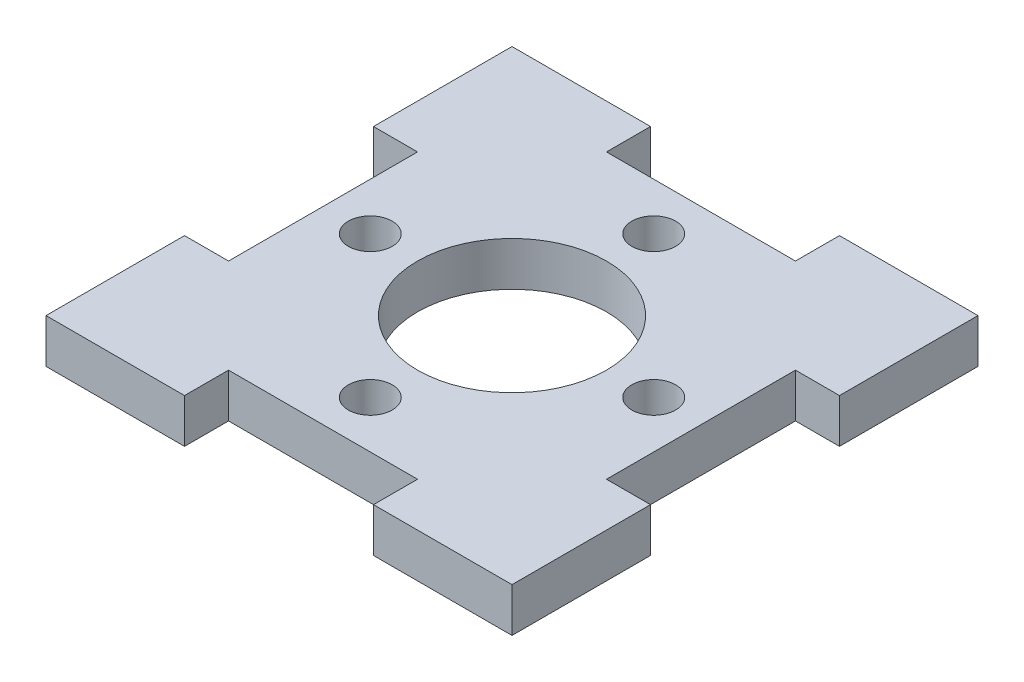
ISO-10303-21;
HEADER;
FILE_DESCRIPTION(('STEP AP214'),'2;1');
FILE_NAME('part.step','',(''),(''),'','','');
FILE_SCHEMA(('AUTOMOTIVE_DESIGN { 1 0 10303 214 1 1 1 1 }'));
ENDSEC;
DATA;
#1=APPLICATION_CONTEXT('core data for automotive mechanical design processes');
#2=APPLICATION_PROTOCOL_DEFINITION('international standard','automotive_design',2000,#1);
#3=PRODUCT_CONTEXT('',#1,'mechanical');
#4=PRODUCT('Part','Part','',(#3));
#5=PRODUCT_RELATED_PRODUCT_CATEGORY('part','',(#4));
#6=PRODUCT_DEFINITION_FORMATION('','',#4);
#7=PRODUCT_DEFINITION_CONTEXT('part definition',#1,'design');
#8=PRODUCT_DEFINITION('design','',#6,#7);
#9=PRODUCT_DEFINITION_SHAPE('','',#8);
#10=(LENGTH_UNIT() NAMED_UNIT(*) SI_UNIT(.MILLI.,.METRE.));
#11=(NAMED_UNIT(*) PLANE_ANGLE_UNIT() SI_UNIT($,.RADIAN.));
#12=(NAMED_UNIT(*) SI_UNIT($,.STERADIAN.) SOLID_ANGLE_UNIT());
#13=UNCERTAINTY_MEASURE_WITH_UNIT(LENGTH_MEASURE(1.E-05),#10,'distance_accuracy_value','');
#14=(GEOMETRIC_REPRESENTATION_CONTEXT(3) GLOBAL_UNCERTAINTY_ASSIGNED_CONTEXT((#13)) GLOBAL_UNIT_ASSIGNED_CONTEXT((#10,
#11,#12)) REPRESENTATION_CONTEXT('',''));
#15=CARTESIAN_POINT('',(0.,0.,0.));
#16=DIRECTION('',(0.,0.,1.));
#17=DIRECTION('',(1.,0.,0.));
#18=AXIS2_PLACEMENT_3D('',#15,#16,#17);
#19=CARTESIAN_POINT('',(2.79193692485513E-13,2.9591,6.34999999999931));
#20=DIRECTION('',(0.,0.,-1.));
#21=DIRECTION('',(-1.,0.,0.));
#22=AXIS2_PLACEMENT_3D('',#19,#20,#21);
#23=PLANE('',#22);
#24=DIRECTION('',(1.,0.,0.));
#25=VECTOR('',#24,1.);
#26=CARTESIAN_POINT('',(2.79193692485513E-13,0.,6.34999999999931));
#27=LINE('',#26,#25);
#28=CARTESIAN_POINT('',(-15.6591,0.,6.35));
#29=VERTEX_POINT('',#28);
#30=CARTESIAN_POINT('',(-12.7000000000001,0.,6.34999999999987));
#31=VERTEX_POINT('',#30);
#32=EDGE_CURVE('E247',#29,#31,#27,.T.);
#33=ORIENTED_EDGE('',*,*,#32,.F.);
#34=DIRECTION('',(0.,-1.,0.));
#35=VECTOR('',#34,1.);
#36=CARTESIAN_POINT('',(-15.6591,2.9591,6.35));
#37=LINE('',#36,#35);
#38=CARTESIAN_POINT('',(-15.6591,2.9591,6.35));
#39=VERTEX_POINT('',#38);
#40=EDGE_CURVE('E11',#39,#29,#37,.T.);
#41=ORIENTED_EDGE('',*,*,#40,.F.);
#42=DIRECTION('',(1.,0.,0.));
#43=VECTOR('',#42,1.);
#44=CARTESIAN_POINT('',(2.79193692485513E-13,2.9591,6.34999999999931));
#45=LINE('',#44,#43);
#46=CARTESIAN_POINT('',(-12.7000000000001,2.9591,6.34999999999987));
#47=VERTEX_POINT('',#46);
#48=EDGE_CURVE('E319',#39,#47,#45,.T.);
#49=ORIENTED_EDGE('',*,*,#48,.T.);
#50=DIRECTION('',(0.,-1.,0.));
#51=VECTOR('',#50,1.);
#52=CARTESIAN_POINT('',(-12.7000000000001,2.9591,6.34999999999987));
#53=LINE('',#52,#51);
#54=EDGE_CURVE('E52',#47,#31,#53,.T.);
#55=ORIENTED_EDGE('',*,*,#54,.T.);
#56=EDGE_LOOP('',(#33,#41,#49,#55));
#57=FACE_BOUND('',#56,.T.);
#58=ADVANCED_FACE('F35',(#57),#23,.T.);
#59=CARTESIAN_POINT('',(-15.6591,2.9591,0.));
#60=DIRECTION('',(1.,0.,0.));
#61=DIRECTION('',(0.,0.,-1.));
#62=AXIS2_PLACEMENT_3D('',#59,#60,#61);
#63=PLANE('',#62);
#64=DIRECTION('',(0.,0.,1.));
#65=VECTOR('',#64,1.);
#66=CARTESIAN_POINT('',(-15.6591,0.,0.));
#67=LINE('',#66,#65);
#68=CARTESIAN_POINT('',(-15.6591,0.,15.6591));
#69=VERTEX_POINT('',#68);
#70=EDGE_CURVE('E244',#29,#69,#67,.T.);
#71=ORIENTED_EDGE('',*,*,#70,.T.);
#72=DIRECTION('',(0.,-1.,0.));
#73=VECTOR('',#72,1.);
#74=CARTESIAN_POINT('',(-15.6591,2.9591,15.6591));
#75=LINE('',#74,#73);
#76=CARTESIAN_POINT('',(-15.6591,2.9591,15.6591));
#77=VERTEX_POINT('',#76);
#78=EDGE_CURVE('E44',#77,#69,#75,.T.);
#79=ORIENTED_EDGE('',*,*,#78,.F.);
#80=DIRECTION('',(0.,0.,1.));
#81=VECTOR('',#80,1.);
#82=CARTESIAN_POINT('',(-15.6591,2.9591,0.));
#83=LINE('',#82,#81);
#84=EDGE_CURVE('E321',#39,#77,#83,.T.);
#85=ORIENTED_EDGE('',*,*,#84,.F.);
#86=ORIENTED_EDGE('',*,*,#40,.T.);
#87=EDGE_LOOP('',(#71,#79,#85,#86));
#88=FACE_BOUND('',#87,.T.);
#89=ADVANCED_FACE('F245',(#88),#63,.F.);
#90=CARTESIAN_POINT('',(0.,2.9591,15.6591));
#91=DIRECTION('',(0.,0.,-1.));
#92=DIRECTION('',(-1.,0.,0.));
#93=AXIS2_PLACEMENT_3D('',#90,#91,#92);
#94=PLANE('',#93);
#95=DIRECTION('',(1.,0.,0.));
#96=VECTOR('',#95,1.);
#97=CARTESIAN_POINT('',(0.,0.,15.6591));
#98=LINE('',#97,#96);
#99=CARTESIAN_POINT('',(-6.35,0.,15.6591));
#100=VERTEX_POINT('',#99);
#101=EDGE_CURVE('E238',#69,#100,#98,.T.);
#102=ORIENTED_EDGE('',*,*,#101,.T.);
#103=DIRECTION('',(0.,-1.,0.));
#104=VECTOR('',#103,1.);
#105=CARTESIAN_POINT('',(-6.35,2.9591,15.6591));
#106=LINE('',#105,#104);
#107=CARTESIAN_POINT('',(-6.35,2.9591,15.6591));
#108=VERTEX_POINT('',#107);
#109=EDGE_CURVE('E229',#108,#100,#106,.T.);
#110=ORIENTED_EDGE('',*,*,#109,.F.);
#111=DIRECTION('',(1.,0.,0.));
#112=VECTOR('',#111,1.);
#113=CARTESIAN_POINT('',(0.,2.9591,15.6591));
#114=LINE('',#113,#112);
#115=EDGE_CURVE('E240',#77,#108,#114,.T.);
#116=ORIENTED_EDGE('',*,*,#115,.F.);
#117=ORIENTED_EDGE('',*,*,#78,.T.);
#118=EDGE_LOOP('',(#102,#110,#116,#117));
#119=FACE_BOUND('',#118,.T.);
#120=ADVANCED_FACE('F236',(#119),#94,.F.);
#121=CARTESIAN_POINT('',(-6.35000000000045,2.9591,1.82406545757228E-13));
#122=DIRECTION('',(-1.,0.,0.));
#123=DIRECTION('',(0.,0.,1.));
#124=AXIS2_PLACEMENT_3D('',#121,#122,#123);
#125=PLANE('',#124);
#126=DIRECTION('',(0.,0.,-1.));
#127=VECTOR('',#126,1.);
#128=CARTESIAN_POINT('',(-6.35000000000045,0.,1.82406545757228E-13));
#129=LINE('',#128,#127);
#130=CARTESIAN_POINT('',(-6.35000000000009,0.,12.6999999999999));
#131=VERTEX_POINT('',#130);
#132=EDGE_CURVE('E249',#100,#131,#129,.T.);
#133=ORIENTED_EDGE('',*,*,#132,.T.);
#134=DIRECTION('',(0.,-1.,0.));
#135=VECTOR('',#134,1.);
#136=CARTESIAN_POINT('',(-6.35000000000009,2.9591,12.6999999999999));
#137=LINE('',#136,#135);
#138=CARTESIAN_POINT('',(-6.35000000000009,2.9591,12.6999999999999));
#139=VERTEX_POINT('',#138);
#140=EDGE_CURVE('E227',#139,#131,#137,.T.);
#141=ORIENTED_EDGE('',*,*,#140,.F.);
#142=DIRECTION('',(0.,0.,-1.));
#143=VECTOR('',#142,1.);
#144=CARTESIAN_POINT('',(-6.35000000000045,2.9591,1.82406545757228E-13));
#145=LINE('',#144,#143);
#146=EDGE_CURVE('E324',#108,#139,#145,.T.);
#147=ORIENTED_EDGE('',*,*,#146,.F.);
#148=ORIENTED_EDGE('',*,*,#109,.T.);
#149=EDGE_LOOP('',(#133,#141,#147,#148));
#150=FACE_BOUND('',#149,.T.);
#151=ADVANCED_FACE('F384',(#150),#125,.F.);
#152=CARTESIAN_POINT('',(0.,2.9591,12.7));
#153=DIRECTION('',(0.,0.,1.));
#154=DIRECTION('',(1.,0.,0.));
#155=AXIS2_PLACEMENT_3D('',#152,#153,#154);
#156=PLANE('',#155);
#157=DIRECTION('',(-1.,0.,0.));
#158=VECTOR('',#157,1.);
#159=CARTESIAN_POINT('',(0.,0.,12.7));
#160=LINE('',#159,#158);
#161=CARTESIAN_POINT('',(6.34999999999991,0.,12.7));
#162=VERTEX_POINT('',#161);
#163=EDGE_CURVE('E257',#162,#131,#160,.T.);
#164=ORIENTED_EDGE('',*,*,#163,.F.);
#165=DIRECTION('',(0.,-1.,0.));
#166=VECTOR('',#165,1.);
#167=CARTESIAN_POINT('',(6.34999999999991,2.9591,12.7));
#168=LINE('',#167,#166);
#169=CARTESIAN_POINT('',(6.34999999999991,2.9591,12.7));
#170=VERTEX_POINT('',#169);
#171=EDGE_CURVE('E225',#170,#162,#168,.T.);
#172=ORIENTED_EDGE('',*,*,#171,.F.);
#173=DIRECTION('',(-1.,0.,0.));
#174=VECTOR('',#173,1.);
#175=CARTESIAN_POINT('',(0.,2.9591,12.7));
#176=LINE('',#175,#174);
#177=EDGE_CURVE('E326',#170,#139,#176,.T.);
#178=ORIENTED_EDGE('',*,*,#177,.T.);
#179=ORIENTED_EDGE('',*,*,#140,.T.);
#180=EDGE_LOOP('',(#164,#172,#178,#179));
#181=FACE_BOUND('',#180,.T.);
#182=ADVANCED_FACE('F387',(#181),#156,.T.);
#183=CARTESIAN_POINT('',(6.34999999999955,2.9591,-1.82406545757208E-13));
#184=DIRECTION('',(-1.,0.,0.));
#185=DIRECTION('',(0.,0.,1.));
#186=AXIS2_PLACEMENT_3D('',#183,#184,#185);
#187=PLANE('',#186);
#188=DIRECTION('',(0.,0.,-1.));
#189=VECTOR('',#188,1.);
#190=CARTESIAN_POINT('',(6.34999999999955,0.,-1.82406545757208E-13));
#191=LINE('',#190,#189);
#192=CARTESIAN_POINT('',(6.35,0.,15.6591));
#193=VERTEX_POINT('',#192);
#194=EDGE_CURVE('E260',#193,#162,#191,.T.);
#195=ORIENTED_EDGE('',*,*,#194,.F.);
#196=DIRECTION('',(0.,-1.,0.));
#197=VECTOR('',#196,1.);
#198=CARTESIAN_POINT('',(6.35,2.9591,15.6591));
#199=LINE('',#198,#197);
#200=CARTESIAN_POINT('',(6.35,2.9591,15.6591));
#201=VERTEX_POINT('',#200);
#202=EDGE_CURVE('E223',#201,#193,#199,.T.);
#203=ORIENTED_EDGE('',*,*,#202,.F.);
#204=DIRECTION('',(0.,0.,-1.));
#205=VECTOR('',#204,1.);
#206=CARTESIAN_POINT('',(6.34999999999955,2.9591,-1.82406545757208E-13));
#207=LINE('',#206,#205);
#208=EDGE_CURVE('E329',#201,#170,#207,.T.);
#209=ORIENTED_EDGE('',*,*,#208,.T.);
#210=ORIENTED_EDGE('',*,*,#171,.T.);
#211=EDGE_LOOP('',(#195,#203,#209,#210));
#212=FACE_BOUND('',#211,.T.);
#213=ADVANCED_FACE('F391',(#212),#187,.T.);
#214=CARTESIAN_POINT('',(0.,2.9591,15.6591));
#215=DIRECTION('',(0.,0.,-1.));
#216=DIRECTION('',(-1.,0.,0.));
#217=AXIS2_PLACEMENT_3D('',#214,#215,#216);
#218=PLANE('',#217);
#219=DIRECTION('',(1.,0.,0.));
#220=VECTOR('',#219,1.);
#221=CARTESIAN_POINT('',(0.,0.,15.6591));
#222=LINE('',#221,#220);
#223=CARTESIAN_POINT('',(15.6591,0.,15.6591));
#224=VERTEX_POINT('',#223);
#225=EDGE_CURVE('E263',#193,#224,#222,.T.);
#226=ORIENTED_EDGE('',*,*,#225,.T.);
#227=DIRECTION('',(0.,-1.,0.));
#228=VECTOR('',#227,1.);
#229=CARTESIAN_POINT('',(15.6591,2.9591,15.6591));
#230=LINE('',#229,#228);
#231=CARTESIAN_POINT('',(15.6591,2.9591,15.6591));
#232=VERTEX_POINT('',#231);
#233=EDGE_CURVE('E221',#232,#224,#230,.T.);
#234=ORIENTED_EDGE('',*,*,#233,.F.);
#235=DIRECTION('',(1.,0.,0.));
#236=VECTOR('',#235,1.);
#237=CARTESIAN_POINT('',(0.,2.9591,15.6591));
#238=LINE('',#237,#236);
#239=EDGE_CURVE('E332',#201,#232,#238,.T.);
#240=ORIENTED_EDGE('',*,*,#239,.F.);
#241=ORIENTED_EDGE('',*,*,#202,.T.);
#242=EDGE_LOOP('',(#226,#234,#240,#241));
#243=FACE_BOUND('',#242,.T.);
#244=ADVANCED_FACE('F395',(#243),#218,.F.);
#245=CARTESIAN_POINT('',(15.6591,2.9591,0.));
#246=DIRECTION('',(1.,0.,0.));
#247=DIRECTION('',(0.,0.,-1.));
#248=AXIS2_PLACEMENT_3D('',#245,#246,#247);
#249=PLANE('',#248);
#250=DIRECTION('',(0.,0.,1.));
#251=VECTOR('',#250,1.);
#252=CARTESIAN_POINT('',(15.6591,0.,0.));
#253=LINE('',#252,#251);
#254=CARTESIAN_POINT('',(15.6591,0.,6.35));
#255=VERTEX_POINT('',#254);
#256=EDGE_CURVE('E266',#255,#224,#253,.T.);
#257=ORIENTED_EDGE('',*,*,#256,.F.);
#258=DIRECTION('',(0.,-1.,0.));
#259=VECTOR('',#258,1.);
#260=CARTESIAN_POINT('',(15.6591,2.9591,6.35));
#261=LINE('',#260,#259);
#262=CARTESIAN_POINT('',(15.6591,2.9591,6.35));
#263=VERTEX_POINT('',#262);
#264=EDGE_CURVE('E219',#263,#255,#261,.T.);
#265=ORIENTED_EDGE('',*,*,#264,.F.);
#266=DIRECTION('',(0.,0.,1.));
#267=VECTOR('',#266,1.);
#268=CARTESIAN_POINT('',(15.6591,2.9591,0.));
#269=LINE('',#268,#267);
#270=EDGE_CURVE('E334',#263,#232,#269,.T.);
#271=ORIENTED_EDGE('',*,*,#270,.T.);
#272=ORIENTED_EDGE('',*,*,#233,.T.);
#273=EDGE_LOOP('',(#257,#265,#271,#272));
#274=FACE_BOUND('',#273,.T.);
#275=ADVANCED_FACE('F399',(#274),#249,.T.);
#276=CARTESIAN_POINT('',(0.,2.9591,6.35000000000023));
#277=DIRECTION('',(0.,0.,1.));
#278=DIRECTION('',(1.,0.,0.));
#279=AXIS2_PLACEMENT_3D('',#276,#277,#278);
#280=PLANE('',#279);
#281=DIRECTION('',(-1.,0.,0.));
#282=VECTOR('',#281,1.);
#283=CARTESIAN_POINT('',(0.,0.,6.35000000000023));
#284=LINE('',#283,#282);
#285=CARTESIAN_POINT('',(12.7,0.,6.35000000000004));
#286=VERTEX_POINT('',#285);
#287=EDGE_CURVE('E269',#255,#286,#284,.T.);
#288=ORIENTED_EDGE('',*,*,#287,.T.);
#289=DIRECTION('',(0.,-1.,0.));
#290=VECTOR('',#289,1.);
#291=CARTESIAN_POINT('',(12.7,2.9591,6.35000000000004));
#292=LINE('',#291,#290);
#293=CARTESIAN_POINT('',(12.7,2.9591,6.35000000000004));
#294=VERTEX_POINT('',#293);
#295=EDGE_CURVE('E217',#294,#286,#292,.T.);
#296=ORIENTED_EDGE('',*,*,#295,.F.);
#297=DIRECTION('',(-1.,0.,0.));
#298=VECTOR('',#297,1.);
#299=CARTESIAN_POINT('',(0.,2.9591,6.35000000000023));
#300=LINE('',#299,#298);
#301=EDGE_CURVE('E337',#263,#294,#300,.T.);
#302=ORIENTED_EDGE('',*,*,#301,.F.);
#303=ORIENTED_EDGE('',*,*,#264,.T.);
#304=EDGE_LOOP('',(#288,#296,#302,#303));
#305=FACE_BOUND('',#304,.T.);
#306=ADVANCED_FACE('F403',(#305),#280,.F.);
#307=CARTESIAN_POINT('',(12.7,2.9591,0.));
#308=DIRECTION('',(1.,0.,0.));
#309=DIRECTION('',(0.,0.,-1.));
#310=AXIS2_PLACEMENT_3D('',#307,#308,#309);
#311=PLANE('',#310);
#312=DIRECTION('',(0.,0.,1.));
#313=VECTOR('',#312,1.);
#314=CARTESIAN_POINT('',(12.7,0.,0.));
#315=LINE('',#314,#313);
#316=CARTESIAN_POINT('',(12.7,0.,-6.34999999999996));
#317=VERTEX_POINT('',#316);
#318=EDGE_CURVE('E272',#317,#286,#315,.T.);
#319=ORIENTED_EDGE('',*,*,#318,.F.);
#320=DIRECTION('',(0.,-1.,0.));
#321=VECTOR('',#320,1.);
#322=CARTESIAN_POINT('',(12.7,2.9591,-6.34999999999996));
#323=LINE('',#322,#321);
#324=CARTESIAN_POINT('',(12.7,2.9591,-6.34999999999996));
#325=VERTEX_POINT('',#324);
#326=EDGE_CURVE('E215',#325,#317,#323,.T.);
#327=ORIENTED_EDGE('',*,*,#326,.F.);
#328=DIRECTION('',(0.,0.,1.));
#329=VECTOR('',#328,1.);
#330=CARTESIAN_POINT('',(12.7,2.9591,0.));
#331=LINE('',#330,#329);
#332=EDGE_CURVE('E339',#325,#294,#331,.T.);
#333=ORIENTED_EDGE('',*,*,#332,.T.);
#334=ORIENTED_EDGE('',*,*,#295,.T.);
#335=EDGE_LOOP('',(#319,#327,#333,#334));
#336=FACE_BOUND('',#335,.T.);
#337=ADVANCED_FACE('F407',(#336),#311,.T.);
#338=CARTESIAN_POINT('',(0.,2.9591,-6.34999999999977));
#339=DIRECTION('',(0.,0.,1.));
#340=DIRECTION('',(1.,0.,0.));
#341=AXIS2_PLACEMENT_3D('',#338,#339,#340);
#342=PLANE('',#341);
#343=DIRECTION('',(-1.,0.,0.));
#344=VECTOR('',#343,1.);
#345=CARTESIAN_POINT('',(0.,0.,-6.34999999999977));
#346=LINE('',#345,#344);
#347=CARTESIAN_POINT('',(15.6591,0.,-6.35));
#348=VERTEX_POINT('',#347);
#349=EDGE_CURVE('E275',#348,#317,#346,.T.);
#350=ORIENTED_EDGE('',*,*,#349,.F.);
#351=DIRECTION('',(0.,-1.,0.));
#352=VECTOR('',#351,1.);
#353=CARTESIAN_POINT('',(15.6591,2.9591,-6.35));
#354=LINE('',#353,#352);
#355=CARTESIAN_POINT('',(15.6591,2.9591,-6.35));
#356=VERTEX_POINT('',#355);
#357=EDGE_CURVE('E213',#356,#348,#354,.T.);
#358=ORIENTED_EDGE('',*,*,#357,.F.);
#359=DIRECTION('',(-1.,0.,0.));
#360=VECTOR('',#359,1.);
#361=CARTESIAN_POINT('',(0.,2.9591,-6.34999999999977));
#362=LINE('',#361,#360);
#363=EDGE_CURVE('E342',#356,#325,#362,.T.);
#364=ORIENTED_EDGE('',*,*,#363,.T.);
#365=ORIENTED_EDGE('',*,*,#326,.T.);
#366=EDGE_LOOP('',(#350,#358,#364,#365));
#367=FACE_BOUND('',#366,.T.);
#368=ADVANCED_FACE('F411',(#367),#342,.T.);
#369=CARTESIAN_POINT('',(15.6591,2.9591,0.));
#370=DIRECTION('',(1.,0.,0.));
#371=DIRECTION('',(0.,0.,-1.));
#372=AXIS2_PLACEMENT_3D('',#369,#370,#371);
#373=PLANE('',#372);
#374=DIRECTION('',(0.,0.,1.));
#375=VECTOR('',#374,1.);
#376=CARTESIAN_POINT('',(15.6591,0.,0.));
#377=LINE('',#376,#375);
#378=CARTESIAN_POINT('',(15.6591,0.,-15.6591));
#379=VERTEX_POINT('',#378);
#380=EDGE_CURVE('E278',#379,#348,#377,.T.);
#381=ORIENTED_EDGE('',*,*,#380,.F.);
#382=DIRECTION('',(0.,-1.,0.));
#383=VECTOR('',#382,1.);
#384=CARTESIAN_POINT('',(15.6591,2.9591,-15.6591));
#385=LINE('',#384,#383);
#386=CARTESIAN_POINT('',(15.6591,2.9591,-15.6591));
#387=VERTEX_POINT('',#386);
#388=EDGE_CURVE('E211',#387,#379,#385,.T.);
#389=ORIENTED_EDGE('',*,*,#388,.F.);
#390=DIRECTION('',(0.,0.,1.));
#391=VECTOR('',#390,1.);
#392=CARTESIAN_POINT('',(15.6591,2.9591,0.));
#393=LINE('',#392,#391);
#394=EDGE_CURVE('E345',#387,#356,#393,.T.);
#395=ORIENTED_EDGE('',*,*,#394,.T.);
#396=ORIENTED_EDGE('',*,*,#357,.T.);
#397=EDGE_LOOP('',(#381,#389,#395,#396));
#398=FACE_BOUND('',#397,.T.);
#399=ADVANCED_FACE('F415',(#398),#373,.T.);
#400=CARTESIAN_POINT('',(0.,2.9591,-15.6591));
#401=DIRECTION('',(0.,0.,-1.));
#402=DIRECTION('',(-1.,0.,0.));
#403=AXIS2_PLACEMENT_3D('',#400,#401,#402);
#404=PLANE('',#403);
#405=DIRECTION('',(1.,0.,0.));
#406=VECTOR('',#405,1.);
#407=CARTESIAN_POINT('',(0.,0.,-15.6591));
#408=LINE('',#407,#406);
#409=CARTESIAN_POINT('',(6.35,0.,-15.6591));
#410=VERTEX_POINT('',#409);
#411=EDGE_CURVE('E281',#410,#379,#408,.T.);
#412=ORIENTED_EDGE('',*,*,#411,.F.);
#413=DIRECTION('',(0.,-1.,0.));
#414=VECTOR('',#413,1.);
#415=CARTESIAN_POINT('',(6.35,2.9591,-15.6591));
#416=LINE('',#415,#414);
#417=CARTESIAN_POINT('',(6.35,2.9591,-15.6591));
#418=VERTEX_POINT('',#417);
#419=EDGE_CURVE('E209',#418,#410,#416,.T.);
#420=ORIENTED_EDGE('',*,*,#419,.F.);
#421=DIRECTION('',(1.,0.,0.));
#422=VECTOR('',#421,1.);
#423=CARTESIAN_POINT('',(0.,2.9591,-15.6591));
#424=LINE('',#423,#422);
#425=EDGE_CURVE('E348',#418,#387,#424,.T.);
#426=ORIENTED_EDGE('',*,*,#425,.T.);
#427=ORIENTED_EDGE('',*,*,#388,.T.);
#428=EDGE_LOOP('',(#412,#420,#426,#427));
#429=FACE_BOUND('',#428,.T.);
#430=ADVANCED_FACE('F419',(#429),#404,.T.);
#431=CARTESIAN_POINT('',(6.35,2.9591,0.));
#432=DIRECTION('',(1.,0.,0.));
#433=DIRECTION('',(0.,0.,-1.));
#434=AXIS2_PLACEMENT_3D('',#431,#432,#433);
#435=PLANE('',#434);
#436=DIRECTION('',(0.,0.,1.));
#437=VECTOR('',#436,1.);
#438=CARTESIAN_POINT('',(6.35,0.,0.));
#439=LINE('',#438,#437);
#440=CARTESIAN_POINT('',(6.35,0.,-12.7));
#441=VERTEX_POINT('',#440);
#442=EDGE_CURVE('E284',#410,#441,#439,.T.);
#443=ORIENTED_EDGE('',*,*,#442,.T.);
#444=DIRECTION('',(0.,-1.,0.));
#445=VECTOR('',#444,1.);
#446=CARTESIAN_POINT('',(6.35,2.9591,-12.7));
#447=LINE('',#446,#445);
#448=CARTESIAN_POINT('',(6.35,2.9591,-12.7));
#449=VERTEX_POINT('',#448);
#450=EDGE_CURVE('E207',#449,#441,#447,.T.);
#451=ORIENTED_EDGE('',*,*,#450,.F.);
#452=DIRECTION('',(0.,0.,1.));
#453=VECTOR('',#452,1.);
#454=CARTESIAN_POINT('',(6.35,2.9591,0.));
#455=LINE('',#454,#453);
#456=EDGE_CURVE('E351',#418,#449,#455,.T.);
#457=ORIENTED_EDGE('',*,*,#456,.F.);
#458=ORIENTED_EDGE('',*,*,#419,.T.);
#459=EDGE_LOOP('',(#443,#451,#457,#458));
#460=FACE_BOUND('',#459,.T.);
#461=ADVANCED_FACE('F423',(#460),#435,.F.);
#462=CARTESIAN_POINT('',(0.,2.9591,-12.7));
#463=DIRECTION('',(0.,0.,-1.));
#464=DIRECTION('',(-1.,0.,0.));
#465=AXIS2_PLACEMENT_3D('',#462,#463,#464);
#466=PLANE('',#465);
#467=DIRECTION('',(1.,0.,0.));
#468=VECTOR('',#467,1.);
#469=CARTESIAN_POINT('',(0.,0.,-12.7));
#470=LINE('',#469,#468);
#471=CARTESIAN_POINT('',(-6.35,0.,-12.7));
#472=VERTEX_POINT('',#471);
#473=EDGE_CURVE('E287',#472,#441,#470,.T.);
#474=ORIENTED_EDGE('',*,*,#473,.F.);
#475=DIRECTION('',(0.,-1.,0.));
#476=VECTOR('',#475,1.);
#477=CARTESIAN_POINT('',(-6.35,2.9591,-12.7));
#478=LINE('',#477,#476);
#479=CARTESIAN_POINT('',(-6.35,2.9591,-12.7));
#480=VERTEX_POINT('',#479);
#481=EDGE_CURVE('E205',#480,#472,#478,.T.);
#482=ORIENTED_EDGE('',*,*,#481,.F.);
#483=DIRECTION('',(1.,0.,0.));
#484=VECTOR('',#483,1.);
#485=CARTESIAN_POINT('',(0.,2.9591,-12.7));
#486=LINE('',#485,#484);
#487=EDGE_CURVE('E353',#480,#449,#486,.T.);
#488=ORIENTED_EDGE('',*,*,#487,.T.);
#489=ORIENTED_EDGE('',*,*,#450,.T.);
#490=EDGE_LOOP('',(#474,#482,#488,#489));
#491=FACE_BOUND('',#490,.T.);
#492=ADVANCED_FACE('F427',(#491),#466,.T.);
#493=CARTESIAN_POINT('',(-6.35,2.9591,0.));
#494=DIRECTION('',(1.,0.,0.));
#495=DIRECTION('',(0.,0.,-1.));
#496=AXIS2_PLACEMENT_3D('',#493,#494,#495);
#497=PLANE('',#496);
#498=DIRECTION('',(0.,0.,1.));
#499=VECTOR('',#498,1.);
#500=CARTESIAN_POINT('',(-6.35,0.,0.));
#501=LINE('',#500,#499);
#502=CARTESIAN_POINT('',(-6.35,0.,-15.6591));
#503=VERTEX_POINT('',#502);
#504=EDGE_CURVE('E290',#503,#472,#501,.T.);
#505=ORIENTED_EDGE('',*,*,#504,.F.);
#506=DIRECTION('',(0.,-1.,0.));
#507=VECTOR('',#506,1.);
#508=CARTESIAN_POINT('',(-6.35,2.9591,-15.6591));
#509=LINE('',#508,#507);
#510=CARTESIAN_POINT('',(-6.35,2.9591,-15.6591));
#511=VERTEX_POINT('',#510);
#512=EDGE_CURVE('E199',#511,#503,#509,.T.);
#513=ORIENTED_EDGE('',*,*,#512,.F.);
#514=DIRECTION('',(0.,0.,1.));
#515=VECTOR('',#514,1.);
#516=CARTESIAN_POINT('',(-6.35,2.9591,0.));
#517=LINE('',#516,#515);
#518=EDGE_CURVE('E356',#511,#480,#517,.T.);
#519=ORIENTED_EDGE('',*,*,#518,.T.);
#520=ORIENTED_EDGE('',*,*,#481,.T.);
#521=EDGE_LOOP('',(#505,#513,#519,#520));
#522=FACE_BOUND('',#521,.T.);
#523=ADVANCED_FACE('F431',(#522),#497,.T.);
#524=CARTESIAN_POINT('',(0.,2.9591,-15.6591));
#525=DIRECTION('',(0.,0.,-1.));
#526=DIRECTION('',(-1.,0.,0.));
#527=AXIS2_PLACEMENT_3D('',#524,#525,#526);
#528=PLANE('',#527);
#529=DIRECTION('',(1.,0.,0.));
#530=VECTOR('',#529,1.);
#531=CARTESIAN_POINT('',(0.,0.,-15.6591));
#532=LINE('',#531,#530);
#533=CARTESIAN_POINT('',(-15.6591,0.,-15.6591));
#534=VERTEX_POINT('',#533);
#535=EDGE_CURVE('E293',#534,#503,#532,.T.);
#536=ORIENTED_EDGE('',*,*,#535,.F.);
#537=DIRECTION('',(0.,-1.,0.));
#538=VECTOR('',#537,1.);
#539=CARTESIAN_POINT('',(-15.6591,2.9591,-15.6591));
#540=LINE('',#539,#538);
#541=CARTESIAN_POINT('',(-15.6591,2.9591,-15.6591));
#542=VERTEX_POINT('',#541);
#543=EDGE_CURVE('E197',#542,#534,#540,.T.);
#544=ORIENTED_EDGE('',*,*,#543,.F.);
#545=DIRECTION('',(1.,0.,0.));
#546=VECTOR('',#545,1.);
#547=CARTESIAN_POINT('',(0.,2.9591,-15.6591));
#548=LINE('',#547,#546);
#549=EDGE_CURVE('E191',#542,#511,#548,.T.);
#550=ORIENTED_EDGE('',*,*,#549,.T.);
#551=ORIENTED_EDGE('',*,*,#512,.T.);
#552=EDGE_LOOP('',(#536,#544,#550,#551));
#553=FACE_BOUND('',#552,.T.);
#554=ADVANCED_FACE('F361',(#553),#528,.T.);
#555=CARTESIAN_POINT('',(-15.6591,2.9591,0.));
#556=DIRECTION('',(1.,0.,0.));
#557=DIRECTION('',(0.,0.,-1.));
#558=AXIS2_PLACEMENT_3D('',#555,#556,#557);
#559=PLANE('',#558);
#560=DIRECTION('',(0.,0.,1.));
#561=VECTOR('',#560,1.);
#562=CARTESIAN_POINT('',(-15.6591,0.,0.));
#563=LINE('',#562,#561);
#564=CARTESIAN_POINT('',(-15.6591,0.,-6.35));
#565=VERTEX_POINT('',#564);
#566=EDGE_CURVE('E196',#534,#565,#563,.T.);
#567=ORIENTED_EDGE('',*,*,#566,.T.);
#568=DIRECTION('',(0.,-1.,0.));
#569=VECTOR('',#568,1.);
#570=CARTESIAN_POINT('',(-15.6591,2.9591,-6.35));
#571=LINE('',#570,#569);
#572=CARTESIAN_POINT('',(-15.6591,2.9591,-6.35));
#573=VERTEX_POINT('',#572);
#574=EDGE_CURVE('E178',#573,#565,#571,.T.);
#575=ORIENTED_EDGE('',*,*,#574,.F.);
#576=DIRECTION('',(0.,0.,1.));
#577=VECTOR('',#576,1.);
#578=CARTESIAN_POINT('',(-15.6591,2.9591,0.));
#579=LINE('',#578,#577);
#580=EDGE_CURVE('E183',#542,#573,#579,.T.);
#581=ORIENTED_EDGE('',*,*,#580,.F.);
#582=ORIENTED_EDGE('',*,*,#543,.T.);
#583=EDGE_LOOP('',(#567,#575,#581,#582));
#584=FACE_BOUND('',#583,.T.);
#585=ADVANCED_FACE('F194',(#584),#559,.F.);
#586=CARTESIAN_POINT('',(-2.79193692485561E-13,2.9591,-6.35000000000069));
#587=DIRECTION('',(0.,0.,-1.));
#588=DIRECTION('',(-1.,0.,0.));
#589=AXIS2_PLACEMENT_3D('',#586,#587,#588);
#590=PLANE('',#589);
#591=DIRECTION('',(1.,0.,0.));
#592=VECTOR('',#591,1.);
#593=CARTESIAN_POINT('',(-2.79193692485561E-13,0.,-6.35000000000069));
#594=LINE('',#593,#592);
#595=CARTESIAN_POINT('',(-12.6999999999999,0.,-6.35000000000013));
#596=VERTEX_POINT('',#595);
#597=EDGE_CURVE('E297',#565,#596,#594,.T.);
#598=ORIENTED_EDGE('',*,*,#597,.T.);
#599=DIRECTION('',(0.,-1.,0.));
#600=VECTOR('',#599,1.);
#601=CARTESIAN_POINT('',(-12.6999999999999,2.9591,-6.35000000000013));
#602=LINE('',#601,#600);
#603=CARTESIAN_POINT('',(-12.6999999999999,2.9591,-6.35000000000013));
#604=VERTEX_POINT('',#603);
#605=EDGE_CURVE('E114',#604,#596,#602,.T.);
#606=ORIENTED_EDGE('',*,*,#605,.F.);
#607=DIRECTION('',(1.,0.,0.));
#608=VECTOR('',#607,1.);
#609=CARTESIAN_POINT('',(-2.79193692485561E-13,2.9591,-6.35000000000069));
#610=LINE('',#609,#608);
#611=EDGE_CURVE('E174',#573,#604,#610,.T.);
#612=ORIENTED_EDGE('',*,*,#611,.F.);
#613=ORIENTED_EDGE('',*,*,#574,.T.);
#614=EDGE_LOOP('',(#598,#606,#612,#613));
#615=FACE_BOUND('',#614,.T.);
#616=ADVANCED_FACE('F176',(#615),#590,.F.);
#617=CARTESIAN_POINT('',(0.,2.9591,0.));
#618=DIRECTION('',(0.,-1.,0.));
#619=DIRECTION('',(0.,0.,-1.));
#620=AXIS2_PLACEMENT_3D('',#617,#618,#619);
#621=CYLINDRICAL_SURFACE('',#620,6.35);
#622=CARTESIAN_POINT('',(0.,2.9591,0.));
#623=DIRECTION('',(0.,1.,0.));
#624=DIRECTION('',(0.,0.,1.));
#625=AXIS2_PLACEMENT_3D('',#622,#623,#624);
#626=CIRCLE('',#625,6.35);
#627=CARTESIAN_POINT('',(0.,2.9591,6.35000000000001));
#628=VERTEX_POINT('',#627);
#629=EDGE_CURVE('E301',#628,#628,#626,.T.);
#630=ORIENTED_EDGE('',*,*,#629,.T.);
#631=EDGE_LOOP('',(#630));
#632=FACE_BOUND('',#631,.T.);
#633=CARTESIAN_POINT('',(0.,0.,0.));
#634=DIRECTION('',(0.,1.,0.));
#635=DIRECTION('',(0.,0.,1.));
#636=AXIS2_PLACEMENT_3D('',#633,#634,#635);
#637=CIRCLE('',#636,6.35);
#638=CARTESIAN_POINT('',(0.,0.,6.35000000000001));
#639=VERTEX_POINT('',#638);
#640=EDGE_CURVE('E251',#639,#639,#637,.T.);
#641=ORIENTED_EDGE('',*,*,#640,.F.);
#642=EDGE_LOOP('',(#641));
#643=FACE_BOUND('',#642,.T.);
#644=ADVANCED_FACE('F37',(#632,#643),#621,.F.);
#645=CARTESIAN_POINT('',(-12.7,2.9591,-1.31838984174237E-13));
#646=DIRECTION('',(-1.,0.,0.));
#647=DIRECTION('',(0.,0.,1.));
#648=AXIS2_PLACEMENT_3D('',#645,#646,#647);
#649=PLANE('',#648);
#650=DIRECTION('',(0.,0.,-1.));
#651=VECTOR('',#650,1.);
#652=CARTESIAN_POINT('',(-12.7,0.,-1.31838984174237E-13));
#653=LINE('',#652,#651);
#654=EDGE_CURVE('E299',#31,#596,#653,.T.);
#655=ORIENTED_EDGE('',*,*,#654,.F.);
#656=ORIENTED_EDGE('',*,*,#54,.F.);
#657=DIRECTION('',(0.,0.,-1.));
#658=VECTOR('',#657,1.);
#659=CARTESIAN_POINT('',(-12.7,2.9591,-1.31838984174237E-13));
#660=LINE('',#659,#658);
#661=EDGE_CURVE('E182',#47,#604,#660,.T.);
#662=ORIENTED_EDGE('',*,*,#661,.T.);
#663=ORIENTED_EDGE('',*,*,#605,.T.);
#664=EDGE_LOOP('',(#655,#656,#662,#663));
#665=FACE_BOUND('',#664,.T.);
#666=ADVANCED_FACE('F364',(#665),#649,.T.);
#667=CARTESIAN_POINT('',(0.,2.9591,0.));
#668=DIRECTION('',(0.,1.,0.));
#669=DIRECTION('',(0.,0.,1.));
#670=AXIS2_PLACEMENT_3D('',#667,#668,#669);
#671=PLANE('',#670);
#672=CARTESIAN_POINT('',(0.,2.9591,-9.525));
#673=DIRECTION('',(0.,1.,0.));
#674=DIRECTION('',(0.,0.,1.));
#675=AXIS2_PLACEMENT_3D('',#672,#673,#674);
#676=CIRCLE('',#675,1.47319999999999);
#677=CARTESIAN_POINT('',(0.,2.9591,-8.05180000000001));
#678=VERTEX_POINT('',#677);
#679=EDGE_CURVE('E516',#678,#678,#676,.T.);
#680=ORIENTED_EDGE('',*,*,#679,.F.);
#681=EDGE_LOOP('',(#680));
#682=FACE_BOUND('',#681,.T.);
#683=CARTESIAN_POINT('',(9.52500000000001,2.9591,0.));
#684=DIRECTION('',(0.,1.,0.));
#685=DIRECTION('',(0.,0.,1.));
#686=AXIS2_PLACEMENT_3D('',#683,#684,#685);
#687=CIRCLE('',#686,1.47319999999999);
#688=CARTESIAN_POINT('',(9.52500000000001,2.9591,1.47319999999998));
#689=VERTEX_POINT('',#688);
#690=EDGE_CURVE('E518',#689,#689,#687,.T.);
#691=ORIENTED_EDGE('',*,*,#690,.F.);
#692=EDGE_LOOP('',(#691));
#693=FACE_BOUND('',#692,.T.);
#694=CARTESIAN_POINT('',(0.,2.9591,9.525));
#695=DIRECTION('',(0.,1.,0.));
#696=DIRECTION('',(0.,0.,1.));
#697=AXIS2_PLACEMENT_3D('',#694,#695,#696);
#698=CIRCLE('',#697,1.47319999999999);
#699=CARTESIAN_POINT('',(0.,2.9591,10.9982));
#700=VERTEX_POINT('',#699);
#701=EDGE_CURVE('E526',#700,#700,#698,.T.);
#702=ORIENTED_EDGE('',*,*,#701,.F.);
#703=EDGE_LOOP('',(#702));
#704=FACE_BOUND('',#703,.T.);
#705=CARTESIAN_POINT('',(-9.525,2.9591,0.));
#706=DIRECTION('',(0.,1.,0.));
#707=DIRECTION('',(0.,0.,1.));
#708=AXIS2_PLACEMENT_3D('',#705,#706,#707);
#709=CIRCLE('',#708,1.47319999999999);
#710=CARTESIAN_POINT('',(-9.525,2.9591,1.47319999999999));
#711=VERTEX_POINT('',#710);
#712=EDGE_CURVE('E308',#711,#711,#709,.T.);
#713=ORIENTED_EDGE('',*,*,#712,.F.);
#714=EDGE_LOOP('',(#713));
#715=FACE_BOUND('',#714,.T.);
#716=ORIENTED_EDGE('',*,*,#629,.F.);
#717=EDGE_LOOP('',(#716));
#718=FACE_BOUND('',#717,.T.);
#719=ORIENTED_EDGE('',*,*,#48,.F.);
#720=ORIENTED_EDGE('',*,*,#84,.T.);
#721=ORIENTED_EDGE('',*,*,#115,.T.);
#722=ORIENTED_EDGE('',*,*,#146,.T.);
#723=ORIENTED_EDGE('',*,*,#177,.F.);
#724=ORIENTED_EDGE('',*,*,#208,.F.);
#725=ORIENTED_EDGE('',*,*,#239,.T.);
#726=ORIENTED_EDGE('',*,*,#270,.F.);
#727=ORIENTED_EDGE('',*,*,#301,.T.);
#728=ORIENTED_EDGE('',*,*,#332,.F.);
#729=ORIENTED_EDGE('',*,*,#363,.F.);
#730=ORIENTED_EDGE('',*,*,#394,.F.);
#731=ORIENTED_EDGE('',*,*,#425,.F.);
#732=ORIENTED_EDGE('',*,*,#456,.T.);
#733=ORIENTED_EDGE('',*,*,#487,.F.);
#734=ORIENTED_EDGE('',*,*,#518,.F.);
#735=ORIENTED_EDGE('',*,*,#549,.F.);
#736=ORIENTED_EDGE('',*,*,#580,.T.);
#737=ORIENTED_EDGE('',*,*,#611,.T.);
#738=ORIENTED_EDGE('',*,*,#661,.F.);
#739=EDGE_LOOP('',(#719,#720,#721,#722,#723,#724,#725,#726,#727,#728,#729,#730,#731,#732,#733,
#734,#735,#736,#737,#738));
#740=FACE_BOUND('',#739,.T.);
#741=ADVANCED_FACE('F188',(#682,#693,#704,#715,#718,#740),#671,.T.);
#742=CARTESIAN_POINT('',(0.,0.,0.));
#743=DIRECTION('',(0.,1.,0.));
#744=DIRECTION('',(0.,0.,1.));
#745=AXIS2_PLACEMENT_3D('',#742,#743,#744);
#746=PLANE('',#745);
#747=CARTESIAN_POINT('',(0.,0.,-9.525));
#748=DIRECTION('',(0.,1.,0.));
#749=DIRECTION('',(0.,0.,1.));
#750=AXIS2_PLACEMENT_3D('',#747,#748,#749);
#751=CIRCLE('',#750,1.47319999999999);
#752=CARTESIAN_POINT('',(0.,0.,-8.05180000000001));
#753=VERTEX_POINT('',#752);
#754=EDGE_CURVE('E513',#753,#753,#751,.T.);
#755=ORIENTED_EDGE('',*,*,#754,.T.);
#756=EDGE_LOOP('',(#755));
#757=FACE_BOUND('',#756,.T.);
#758=CARTESIAN_POINT('',(9.52500000000001,0.,0.));
#759=DIRECTION('',(0.,1.,0.));
#760=DIRECTION('',(0.,0.,1.));
#761=AXIS2_PLACEMENT_3D('',#758,#759,#760);
#762=CIRCLE('',#761,1.47319999999999);
#763=CARTESIAN_POINT('',(9.52500000000001,0.,1.47319999999999));
#764=VERTEX_POINT('',#763);
#765=EDGE_CURVE('E523',#764,#764,#762,.T.);
#766=ORIENTED_EDGE('',*,*,#765,.T.);
#767=EDGE_LOOP('',(#766));
#768=FACE_BOUND('',#767,.T.);
#769=CARTESIAN_POINT('',(0.,0.,9.525));
#770=DIRECTION('',(0.,1.,0.));
#771=DIRECTION('',(0.,0.,1.));
#772=AXIS2_PLACEMENT_3D('',#769,#770,#771);
#773=CIRCLE('',#772,1.47319999999999);
#774=CARTESIAN_POINT('',(0.,0.,10.9982));
#775=VERTEX_POINT('',#774);
#776=EDGE_CURVE('E313',#775,#775,#773,.T.);
#777=ORIENTED_EDGE('',*,*,#776,.T.);
#778=EDGE_LOOP('',(#777));
#779=FACE_BOUND('',#778,.T.);
#780=CARTESIAN_POINT('',(-9.525,0.,0.));
#781=DIRECTION('',(0.,1.,0.));
#782=DIRECTION('',(0.,0.,1.));
#783=AXIS2_PLACEMENT_3D('',#780,#781,#782);
#784=CIRCLE('',#783,1.47319999999999);
#785=CARTESIAN_POINT('',(-9.525,0.,1.4732));
#786=VERTEX_POINT('',#785);
#787=EDGE_CURVE('E304',#786,#786,#784,.T.);
#788=ORIENTED_EDGE('',*,*,#787,.T.);
#789=EDGE_LOOP('',(#788));
#790=FACE_BOUND('',#789,.T.);
#791=ORIENTED_EDGE('',*,*,#640,.T.);
#792=EDGE_LOOP('',(#791));
#793=FACE_BOUND('',#792,.T.);
#794=ORIENTED_EDGE('',*,*,#32,.T.);
#795=ORIENTED_EDGE('',*,*,#654,.T.);
#796=ORIENTED_EDGE('',*,*,#597,.F.);
#797=ORIENTED_EDGE('',*,*,#566,.F.);
#798=ORIENTED_EDGE('',*,*,#535,.T.);
#799=ORIENTED_EDGE('',*,*,#504,.T.);
#800=ORIENTED_EDGE('',*,*,#473,.T.);
#801=ORIENTED_EDGE('',*,*,#442,.F.);
#802=ORIENTED_EDGE('',*,*,#411,.T.);
#803=ORIENTED_EDGE('',*,*,#380,.T.);
#804=ORIENTED_EDGE('',*,*,#349,.T.);
#805=ORIENTED_EDGE('',*,*,#318,.T.);
#806=ORIENTED_EDGE('',*,*,#287,.F.);
#807=ORIENTED_EDGE('',*,*,#256,.T.);
#808=ORIENTED_EDGE('',*,*,#225,.F.);
#809=ORIENTED_EDGE('',*,*,#194,.T.);
#810=ORIENTED_EDGE('',*,*,#163,.T.);
#811=ORIENTED_EDGE('',*,*,#132,.F.);
#812=ORIENTED_EDGE('',*,*,#101,.F.);
#813=ORIENTED_EDGE('',*,*,#70,.F.);
#814=EDGE_LOOP('',(#794,#795,#796,#797,#798,#799,#800,#801,#802,#803,#804,#805,#806,#807,#808,
#809,#810,#811,#812,#813));
#815=FACE_BOUND('',#814,.T.);
#816=ADVANCED_FACE('F363',(#757,#768,#779,#790,#793,#815),#746,.F.);
#817=CARTESIAN_POINT('',(-9.525,2.9591,0.));
#818=DIRECTION('',(0.,1.,0.));
#819=DIRECTION('',(0.,0.,1.));
#820=AXIS2_PLACEMENT_3D('',#817,#818,#819);
#821=CYLINDRICAL_SURFACE('',#820,1.47319999999999);
#822=ORIENTED_EDGE('',*,*,#787,.F.);
#823=EDGE_LOOP('',(#822));
#824=FACE_BOUND('',#823,.T.);
#825=ORIENTED_EDGE('',*,*,#712,.T.);
#826=EDGE_LOOP('',(#825));
#827=FACE_BOUND('',#826,.T.);
#828=ADVANCED_FACE('F467',(#824,#827),#821,.F.);
#829=CARTESIAN_POINT('',(0.,2.9591,9.525));
#830=DIRECTION('',(0.,1.,0.));
#831=DIRECTION('',(0.,0.,1.));
#832=AXIS2_PLACEMENT_3D('',#829,#830,#831);
#833=CYLINDRICAL_SURFACE('',#832,1.47319999999999);
#834=ORIENTED_EDGE('',*,*,#776,.F.);
#835=EDGE_LOOP('',(#834));
#836=FACE_BOUND('',#835,.T.);
#837=ORIENTED_EDGE('',*,*,#701,.T.);
#838=EDGE_LOOP('',(#837));
#839=FACE_BOUND('',#838,.T.);
#840=ADVANCED_FACE('F476',(#836,#839),#833,.F.);
#841=CARTESIAN_POINT('',(9.52500000000001,2.9591,0.));
#842=DIRECTION('',(0.,1.,0.));
#843=DIRECTION('',(0.,0.,1.));
#844=AXIS2_PLACEMENT_3D('',#841,#842,#843);
#845=CYLINDRICAL_SURFACE('',#844,1.47319999999999);
#846=ORIENTED_EDGE('',*,*,#765,.F.);
#847=EDGE_LOOP('',(#846));
#848=FACE_BOUND('',#847,.T.);
#849=ORIENTED_EDGE('',*,*,#690,.T.);
#850=EDGE_LOOP('',(#849));
#851=FACE_BOUND('',#850,.T.);
#852=ADVANCED_FACE('F486',(#848,#851),#845,.F.);
#853=CARTESIAN_POINT('',(0.,2.9591,-9.525));
#854=DIRECTION('',(0.,1.,0.));
#855=DIRECTION('',(0.,0.,1.));
#856=AXIS2_PLACEMENT_3D('',#853,#854,#855);
#857=CYLINDRICAL_SURFACE('',#856,1.47319999999999);
#858=ORIENTED_EDGE('',*,*,#754,.F.);
#859=EDGE_LOOP('',(#858));
#860=FACE_BOUND('',#859,.T.);
#861=ORIENTED_EDGE('',*,*,#679,.T.);
#862=EDGE_LOOP('',(#861));
#863=FACE_BOUND('',#862,.T.);
#864=ADVANCED_FACE('F496',(#860,#863),#857,.F.);
#865=CLOSED_SHELL('',(#58,#89,#120,#151,#182,#213,#244,#275,#306,#337,#368,#399,#430,#461,#492,
#523,#554,#585,#616,#644,#666,#741,#816,#828,#840,#852,#864));
#866=MANIFOLD_SOLID_BREP('B2',#865);
#867=ADVANCED_BREP_SHAPE_REPRESENTATION('',(#18,#866),#14);
#868=SHAPE_DEFINITION_REPRESENTATION(#9,#867);
ENDSEC;
END-ISO-10303-21;
